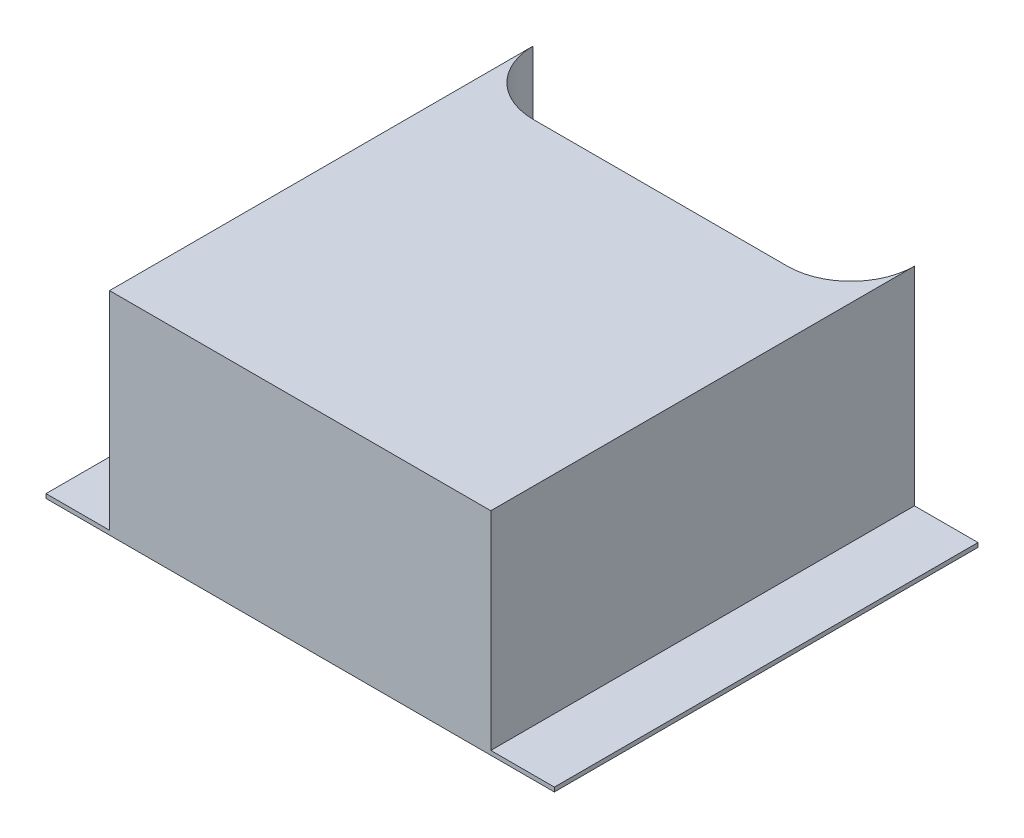
ISO-10303-21;
HEADER;
FILE_DESCRIPTION(('STEP AP214'),'2;1');
FILE_NAME('part.step','',(''),(''),'','','');
FILE_SCHEMA(('AUTOMOTIVE_DESIGN { 1 0 10303 214 1 1 1 1 }'));
ENDSEC;
DATA;
#1=APPLICATION_CONTEXT('core data for automotive mechanical design processes');
#2=APPLICATION_PROTOCOL_DEFINITION('international standard','automotive_design',2000,#1);
#3=PRODUCT_CONTEXT('',#1,'mechanical');
#4=PRODUCT('Part','Part','',(#3));
#5=PRODUCT_RELATED_PRODUCT_CATEGORY('part','',(#4));
#6=PRODUCT_DEFINITION_FORMATION('','',#4);
#7=PRODUCT_DEFINITION_CONTEXT('part definition',#1,'design');
#8=PRODUCT_DEFINITION('design','',#6,#7);
#9=PRODUCT_DEFINITION_SHAPE('','',#8);
#10=(LENGTH_UNIT() NAMED_UNIT(*) SI_UNIT(.MILLI.,.METRE.));
#11=(NAMED_UNIT(*) PLANE_ANGLE_UNIT() SI_UNIT($,.RADIAN.));
#12=(NAMED_UNIT(*) SI_UNIT($,.STERADIAN.) SOLID_ANGLE_UNIT());
#13=UNCERTAINTY_MEASURE_WITH_UNIT(LENGTH_MEASURE(1.E-05),#10,'distance_accuracy_value','');
#14=(GEOMETRIC_REPRESENTATION_CONTEXT(3) GLOBAL_UNCERTAINTY_ASSIGNED_CONTEXT((#13)) GLOBAL_UNIT_ASSIGNED_CONTEXT((#10,
#11,#12)) REPRESENTATION_CONTEXT('',''));
#15=CARTESIAN_POINT('',(0.,0.,0.));
#16=DIRECTION('',(0.,0.,1.));
#17=DIRECTION('',(1.,0.,0.));
#18=AXIS2_PLACEMENT_3D('',#15,#16,#17);
#19=CARTESIAN_POINT('',(0.,0.01,0.));
#20=DIRECTION('',(0.,1.,0.));
#21=DIRECTION('',(0.,0.,1.));
#22=AXIS2_PLACEMENT_3D('',#19,#20,#21);
#23=PLANE('',#22);
#24=DIRECTION('',(1.,0.,0.));
#25=VECTOR('',#24,1.);
#26=CARTESIAN_POINT('',(-1.87,0.01,-1.6));
#27=LINE('',#26,#25);
#28=CARTESIAN_POINT('',(-1.72,0.01,-1.6));
#29=VERTEX_POINT('',#28);
#30=CARTESIAN_POINT('',(-1.87,0.01,-1.6));
#31=VERTEX_POINT('',#30);
#32=EDGE_CURVE('E198',#29,#31,#27,.F.);
#33=ORIENTED_EDGE('',*,*,#32,.T.);
#34=DIRECTION('',(0.,0.,-1.));
#35=VECTOR('',#34,1.);
#36=CARTESIAN_POINT('',(-1.87,0.01,-0.6));
#37=LINE('',#36,#35);
#38=CARTESIAN_POINT('',(-1.87,0.01,-0.6));
#39=VERTEX_POINT('',#38);
#40=EDGE_CURVE('E126',#31,#39,#37,.F.);
#41=ORIENTED_EDGE('',*,*,#40,.T.);
#42=DIRECTION('',(-1.,0.,0.));
#43=VECTOR('',#42,1.);
#44=CARTESIAN_POINT('',(-0.67,0.01,-0.6));
#45=LINE('',#44,#43);
#46=CARTESIAN_POINT('',(-1.72,0.01,-0.6));
#47=VERTEX_POINT('',#46);
#48=EDGE_CURVE('E143',#39,#47,#45,.F.);
#49=ORIENTED_EDGE('',*,*,#48,.T.);
#50=DIRECTION('',(0.,0.,-1.));
#51=VECTOR('',#50,1.);
#52=CARTESIAN_POINT('',(-1.72,0.01,-1.6));
#53=LINE('',#52,#51);
#54=EDGE_CURVE('E207',#47,#29,#53,.T.);
#55=ORIENTED_EDGE('',*,*,#54,.T.);
#56=EDGE_LOOP('',(#33,#41,#49,#55));
#57=FACE_BOUND('',#56,.T.);
#58=ADVANCED_FACE('F17',(#57),#23,.T.);
#59=CARTESIAN_POINT('',(0.,0.01,0.));
#60=DIRECTION('',(0.,1.,0.));
#61=DIRECTION('',(0.,0.,1.));
#62=AXIS2_PLACEMENT_3D('',#59,#60,#61);
#63=PLANE('',#62);
#64=DIRECTION('',(1.,0.,0.));
#65=VECTOR('',#64,1.);
#66=CARTESIAN_POINT('',(-0.82,0.01,-1.6));
#67=LINE('',#66,#65);
#68=CARTESIAN_POINT('',(-0.67,0.01,-1.6));
#69=VERTEX_POINT('',#68);
#70=CARTESIAN_POINT('',(-0.82,0.01,-1.6));
#71=VERTEX_POINT('',#70);
#72=EDGE_CURVE('E112',#69,#71,#67,.F.);
#73=ORIENTED_EDGE('',*,*,#72,.T.);
#74=DIRECTION('',(0.,0.,1.));
#75=VECTOR('',#74,1.);
#76=CARTESIAN_POINT('',(-0.82,0.01,-1.6));
#77=LINE('',#76,#75);
#78=CARTESIAN_POINT('',(-0.82,0.01,-0.6));
#79=VERTEX_POINT('',#78);
#80=EDGE_CURVE('E70',#71,#79,#77,.T.);
#81=ORIENTED_EDGE('',*,*,#80,.T.);
#82=DIRECTION('',(-1.,0.,0.));
#83=VECTOR('',#82,1.);
#84=CARTESIAN_POINT('',(-0.67,0.01,-0.6));
#85=LINE('',#84,#83);
#86=CARTESIAN_POINT('',(-0.67,0.01,-0.6));
#87=VERTEX_POINT('',#86);
#88=EDGE_CURVE('E111',#79,#87,#85,.F.);
#89=ORIENTED_EDGE('',*,*,#88,.T.);
#90=DIRECTION('',(0.,0.,1.));
#91=VECTOR('',#90,1.);
#92=CARTESIAN_POINT('',(-0.67,0.01,-1.6));
#93=LINE('',#92,#91);
#94=EDGE_CURVE('E79',#87,#69,#93,.F.);
#95=ORIENTED_EDGE('',*,*,#94,.T.);
#96=EDGE_LOOP('',(#73,#81,#89,#95));
#97=FACE_BOUND('',#96,.T.);
#98=ADVANCED_FACE('F110',(#97),#63,.T.);
#99=CARTESIAN_POINT('',(-0.82,-3.203513695928,-1.6));
#100=DIRECTION('',(-1.,0.,0.));
#101=DIRECTION('',(0.,0.,1.));
#102=AXIS2_PLACEMENT_3D('',#99,#100,#101);
#103=PLANE('',#102);
#104=DIRECTION('',(0.,1.,0.));
#105=VECTOR('',#104,1.);
#106=CARTESIAN_POINT('',(-0.82,-1.562049935181,-1.6));
#107=LINE('',#106,#105);
#108=CARTESIAN_POINT('',(-0.82,0.5,-1.6));
#109=VERTEX_POINT('',#108);
#110=EDGE_CURVE('E219',#71,#109,#107,.T.);
#111=ORIENTED_EDGE('',*,*,#110,.T.);
#112=DIRECTION('',(0.,0.,-1.));
#113=VECTOR('',#112,1.);
#114=CARTESIAN_POINT('',(-0.82,0.5,-1.6));
#115=LINE('',#114,#113);
#116=CARTESIAN_POINT('',(-0.82,0.5,-0.6));
#117=VERTEX_POINT('',#116);
#118=EDGE_CURVE('E61',#109,#117,#115,.F.);
#119=ORIENTED_EDGE('',*,*,#118,.T.);
#120=DIRECTION('',(0.,1.,0.));
#121=VECTOR('',#120,1.);
#122=CARTESIAN_POINT('',(-0.82,-1.562049935181,-0.6));
#123=LINE('',#122,#121);
#124=EDGE_CURVE('E120',#117,#79,#123,.F.);
#125=ORIENTED_EDGE('',*,*,#124,.T.);
#126=ORIENTED_EDGE('',*,*,#80,.F.);
#127=EDGE_LOOP('',(#111,#119,#125,#126));
#128=FACE_BOUND('',#127,.T.);
#129=ADVANCED_FACE('F125',(#128),#103,.F.);
#130=CARTESIAN_POINT('',(-1.57,0.5,-1.6));
#131=DIRECTION('',(0.,-1.,0.));
#132=DIRECTION('',(0.,0.,-1.));
#133=AXIS2_PLACEMENT_3D('',#130,#131,#132);
#134=PLANE('',#133);
#135=DIRECTION('',(0.,0.,-1.));
#136=VECTOR('',#135,1.);
#137=CARTESIAN_POINT('',(-1.72,0.5,-1.6));
#138=LINE('',#137,#136);
#139=CARTESIAN_POINT('',(-1.72,0.5,-1.6));
#140=VERTEX_POINT('',#139);
#141=CARTESIAN_POINT('',(-1.72,0.5,-0.6));
#142=VERTEX_POINT('',#141);
#143=EDGE_CURVE('E202',#140,#142,#138,.F.);
#144=ORIENTED_EDGE('',*,*,#143,.T.);
#145=DIRECTION('',(-1.,0.,0.));
#146=VECTOR('',#145,1.);
#147=CARTESIAN_POINT('',(-0.67,0.5,-0.6));
#148=LINE('',#147,#146);
#149=EDGE_CURVE('E136',#142,#117,#148,.F.);
#150=ORIENTED_EDGE('',*,*,#149,.T.);
#151=ORIENTED_EDGE('',*,*,#118,.F.);
#152=CARTESIAN_POINT('',(-0.97,0.5,-1.6));
#153=DIRECTION('',(0.,1.,0.));
#154=DIRECTION('',(0.,0.,1.));
#155=AXIS2_PLACEMENT_3D('',#152,#153,#154);
#156=CIRCLE('',#155,0.15);
#157=CARTESIAN_POINT('',(-0.97,0.5,-1.45));
#158=VERTEX_POINT('',#157);
#159=EDGE_CURVE('E20',#109,#158,#156,.F.);
#160=ORIENTED_EDGE('',*,*,#159,.T.);
#161=DIRECTION('',(1.,0.,0.));
#162=VECTOR('',#161,1.);
#163=CARTESIAN_POINT('',(-1.57,0.5,-1.45));
#164=LINE('',#163,#162);
#165=CARTESIAN_POINT('',(-1.57,0.5,-1.45));
#166=VERTEX_POINT('',#165);
#167=EDGE_CURVE('E158',#158,#166,#164,.F.);
#168=ORIENTED_EDGE('',*,*,#167,.T.);
#169=CARTESIAN_POINT('',(-1.57,0.5,-1.6));
#170=DIRECTION('',(0.,1.,0.));
#171=DIRECTION('',(0.,0.,1.));
#172=AXIS2_PLACEMENT_3D('',#169,#170,#171);
#173=CIRCLE('',#172,0.15);
#174=EDGE_CURVE('E149',#166,#140,#173,.F.);
#175=ORIENTED_EDGE('',*,*,#174,.T.);
#176=EDGE_LOOP('',(#144,#150,#151,#160,#168,#175));
#177=FACE_BOUND('',#176,.T.);
#178=ADVANCED_FACE('F356',(#177),#134,.F.);
#179=CARTESIAN_POINT('',(-1.72,-3.203513695928,-1.6));
#180=DIRECTION('',(1.,0.,0.));
#181=DIRECTION('',(0.,0.,-1.));
#182=AXIS2_PLACEMENT_3D('',#179,#180,#181);
#183=PLANE('',#182);
#184=DIRECTION('',(0.,1.,0.));
#185=VECTOR('',#184,1.);
#186=CARTESIAN_POINT('',(-1.72,-1.562049935181,-1.6));
#187=LINE('',#186,#185);
#188=EDGE_CURVE('E151',#140,#29,#187,.F.);
#189=ORIENTED_EDGE('',*,*,#188,.T.);
#190=ORIENTED_EDGE('',*,*,#54,.F.);
#191=DIRECTION('',(0.,1.,0.));
#192=VECTOR('',#191,1.);
#193=CARTESIAN_POINT('',(-1.72,-1.562049935181,-0.6));
#194=LINE('',#193,#192);
#195=EDGE_CURVE('E138',#47,#142,#194,.T.);
#196=ORIENTED_EDGE('',*,*,#195,.T.);
#197=ORIENTED_EDGE('',*,*,#143,.F.);
#198=EDGE_LOOP('',(#189,#190,#196,#197));
#199=FACE_BOUND('',#198,.T.);
#200=ADVANCED_FACE('F348',(#199),#183,.F.);
#201=CARTESIAN_POINT('',(-1.87,-1.562049935181,-1.6));
#202=DIRECTION('',(0.,0.,1.));
#203=DIRECTION('',(1.,0.,0.));
#204=AXIS2_PLACEMENT_3D('',#201,#202,#203);
#205=PLANE('',#204);
#206=DIRECTION('',(0.,1.,0.));
#207=VECTOR('',#206,1.);
#208=CARTESIAN_POINT('',(-1.72,-1.562049935181,-1.6));
#209=LINE('',#208,#207);
#210=CARTESIAN_POINT('',(-1.72,0.,-1.6));
#211=VERTEX_POINT('',#210);
#212=EDGE_CURVE('E155',#29,#211,#209,.F.);
#213=ORIENTED_EDGE('',*,*,#212,.T.);
#214=DIRECTION('',(1.,0.,0.));
#215=VECTOR('',#214,1.);
#216=CARTESIAN_POINT('',(0.,0.,-1.6));
#217=LINE('',#216,#215);
#218=CARTESIAN_POINT('',(-1.87,0.,-1.6));
#219=VERTEX_POINT('',#218);
#220=EDGE_CURVE('E193',#211,#219,#217,.F.);
#221=ORIENTED_EDGE('',*,*,#220,.T.);
#222=DIRECTION('',(0.,1.,0.));
#223=VECTOR('',#222,1.);
#224=CARTESIAN_POINT('',(-1.87,-1.562049935181,-1.6));
#225=LINE('',#224,#223);
#226=EDGE_CURVE('E128',#219,#31,#225,.T.);
#227=ORIENTED_EDGE('',*,*,#226,.T.);
#228=ORIENTED_EDGE('',*,*,#32,.F.);
#229=EDGE_LOOP('',(#213,#221,#227,#228));
#230=FACE_BOUND('',#229,.T.);
#231=ADVANCED_FACE('F249',(#230),#205,.F.);
#232=CARTESIAN_POINT('',(-1.87,-1.562049935181,-0.6));
#233=DIRECTION('',(1.,0.,0.));
#234=DIRECTION('',(0.,0.,-1.));
#235=AXIS2_PLACEMENT_3D('',#232,#233,#234);
#236=PLANE('',#235);
#237=ORIENTED_EDGE('',*,*,#226,.F.);
#238=DIRECTION('',(0.,0.,1.));
#239=VECTOR('',#238,1.);
#240=CARTESIAN_POINT('',(-1.87,0.,0.));
#241=LINE('',#240,#239);
#242=CARTESIAN_POINT('',(-1.87,0.,-0.6));
#243=VERTEX_POINT('',#242);
#244=EDGE_CURVE('E184',#219,#243,#241,.T.);
#245=ORIENTED_EDGE('',*,*,#244,.T.);
#246=DIRECTION('',(0.,1.,0.));
#247=VECTOR('',#246,1.);
#248=CARTESIAN_POINT('',(-1.87,-1.562049935181,-0.6));
#249=LINE('',#248,#247);
#250=EDGE_CURVE('E123',#243,#39,#249,.T.);
#251=ORIENTED_EDGE('',*,*,#250,.T.);
#252=ORIENTED_EDGE('',*,*,#40,.F.);
#253=EDGE_LOOP('',(#237,#245,#251,#252));
#254=FACE_BOUND('',#253,.T.);
#255=ADVANCED_FACE('F240',(#254),#236,.F.);
#256=CARTESIAN_POINT('',(-0.67,-1.562049935181,-0.6));
#257=DIRECTION('',(0.,0.,-1.));
#258=DIRECTION('',(-1.,0.,0.));
#259=AXIS2_PLACEMENT_3D('',#256,#257,#258);
#260=PLANE('',#259);
#261=ORIENTED_EDGE('',*,*,#195,.F.);
#262=ORIENTED_EDGE('',*,*,#48,.F.);
#263=ORIENTED_EDGE('',*,*,#250,.F.);
#264=DIRECTION('',(1.,0.,0.));
#265=VECTOR('',#264,1.);
#266=CARTESIAN_POINT('',(0.,0.,-0.6));
#267=LINE('',#266,#265);
#268=CARTESIAN_POINT('',(-0.67,0.,-0.6));
#269=VERTEX_POINT('',#268);
#270=EDGE_CURVE('E177',#243,#269,#267,.T.);
#271=ORIENTED_EDGE('',*,*,#270,.T.);
#272=DIRECTION('',(0.,1.,0.));
#273=VECTOR('',#272,1.);
#274=CARTESIAN_POINT('',(-0.67,-1.562049935181,-0.6));
#275=LINE('',#274,#273);
#276=EDGE_CURVE('E122',#269,#87,#275,.T.);
#277=ORIENTED_EDGE('',*,*,#276,.T.);
#278=ORIENTED_EDGE('',*,*,#88,.F.);
#279=ORIENTED_EDGE('',*,*,#124,.F.);
#280=ORIENTED_EDGE('',*,*,#149,.F.);
#281=EDGE_LOOP('',(#261,#262,#263,#271,#277,#278,#279,#280));
#282=FACE_BOUND('',#281,.T.);
#283=ADVANCED_FACE('F118',(#282),#260,.F.);
#284=CARTESIAN_POINT('',(-0.67,-1.562049935181,-1.6));
#285=DIRECTION('',(-1.,0.,0.));
#286=DIRECTION('',(0.,0.,1.));
#287=AXIS2_PLACEMENT_3D('',#284,#285,#286);
#288=PLANE('',#287);
#289=ORIENTED_EDGE('',*,*,#276,.F.);
#290=DIRECTION('',(0.,0.,1.));
#291=VECTOR('',#290,1.);
#292=CARTESIAN_POINT('',(-0.67,0.,0.));
#293=LINE('',#292,#291);
#294=CARTESIAN_POINT('',(-0.67,0.,-1.6));
#295=VERTEX_POINT('',#294);
#296=EDGE_CURVE('E174',#269,#295,#293,.F.);
#297=ORIENTED_EDGE('',*,*,#296,.T.);
#298=DIRECTION('',(0.,1.,0.));
#299=VECTOR('',#298,1.);
#300=CARTESIAN_POINT('',(-0.67,-1.562049935181,-1.6));
#301=LINE('',#300,#299);
#302=EDGE_CURVE('E169',#295,#69,#301,.T.);
#303=ORIENTED_EDGE('',*,*,#302,.T.);
#304=ORIENTED_EDGE('',*,*,#94,.F.);
#305=EDGE_LOOP('',(#289,#297,#303,#304));
#306=FACE_BOUND('',#305,.T.);
#307=ADVANCED_FACE('F270',(#306),#288,.F.);
#308=CARTESIAN_POINT('',(-0.82,-1.562049935181,-1.6));
#309=DIRECTION('',(0.,0.,1.));
#310=DIRECTION('',(1.,0.,0.));
#311=AXIS2_PLACEMENT_3D('',#308,#309,#310);
#312=PLANE('',#311);
#313=ORIENTED_EDGE('',*,*,#302,.F.);
#314=DIRECTION('',(1.,0.,0.));
#315=VECTOR('',#314,1.);
#316=CARTESIAN_POINT('',(0.,0.,-1.6));
#317=LINE('',#316,#315);
#318=CARTESIAN_POINT('',(-0.82,0.,-1.6));
#319=VERTEX_POINT('',#318);
#320=EDGE_CURVE('E148',#295,#319,#317,.F.);
#321=ORIENTED_EDGE('',*,*,#320,.T.);
#322=DIRECTION('',(0.,1.,0.));
#323=VECTOR('',#322,1.);
#324=CARTESIAN_POINT('',(-0.82,-1.562049935181,-1.6));
#325=LINE('',#324,#323);
#326=EDGE_CURVE('E161',#319,#71,#325,.T.);
#327=ORIENTED_EDGE('',*,*,#326,.T.);
#328=ORIENTED_EDGE('',*,*,#72,.F.);
#329=EDGE_LOOP('',(#313,#321,#327,#328));
#330=FACE_BOUND('',#329,.T.);
#331=ADVANCED_FACE('F268',(#330),#312,.F.);
#332=CARTESIAN_POINT('',(-0.97,-1.562049935181,-1.6));
#333=DIRECTION('',(0.,1.,0.));
#334=DIRECTION('',(0.,0.,1.));
#335=AXIS2_PLACEMENT_3D('',#332,#333,#334);
#336=CYLINDRICAL_SURFACE('',#335,0.15);
#337=CARTESIAN_POINT('',(-0.97,0.,-1.6));
#338=DIRECTION('',(0.,1.,0.));
#339=DIRECTION('',(0.,0.,1.));
#340=AXIS2_PLACEMENT_3D('',#337,#338,#339);
#341=CIRCLE('',#340,0.15);
#342=CARTESIAN_POINT('',(-0.97,0.,-1.45));
#343=VERTEX_POINT('',#342);
#344=EDGE_CURVE('E146',#319,#343,#341,.F.);
#345=ORIENTED_EDGE('',*,*,#344,.T.);
#346=DIRECTION('',(0.,1.,0.));
#347=VECTOR('',#346,1.);
#348=CARTESIAN_POINT('',(-0.97,-1.562049935181,-1.45));
#349=LINE('',#348,#347);
#350=EDGE_CURVE('E152',#343,#158,#349,.T.);
#351=ORIENTED_EDGE('',*,*,#350,.T.);
#352=ORIENTED_EDGE('',*,*,#159,.F.);
#353=ORIENTED_EDGE('',*,*,#110,.F.);
#354=ORIENTED_EDGE('',*,*,#326,.F.);
#355=EDGE_LOOP('',(#345,#351,#352,#353,#354));
#356=FACE_BOUND('',#355,.T.);
#357=ADVANCED_FACE('F265',(#356),#336,.F.);
#358=CARTESIAN_POINT('',(-1.57,-1.562049935181,-1.45));
#359=DIRECTION('',(0.,0.,1.));
#360=DIRECTION('',(1.,0.,0.));
#361=AXIS2_PLACEMENT_3D('',#358,#359,#360);
#362=PLANE('',#361);
#363=DIRECTION('',(1.,0.,0.));
#364=VECTOR('',#363,1.);
#365=CARTESIAN_POINT('',(0.,0.,-1.45));
#366=LINE('',#365,#364);
#367=CARTESIAN_POINT('',(-1.57,0.,-1.45));
#368=VERTEX_POINT('',#367);
#369=EDGE_CURVE('E26',#343,#368,#366,.F.);
#370=ORIENTED_EDGE('',*,*,#369,.T.);
#371=DIRECTION('',(0.,1.,0.));
#372=VECTOR('',#371,1.);
#373=CARTESIAN_POINT('',(-1.57,-1.562049935181,-1.45));
#374=LINE('',#373,#372);
#375=EDGE_CURVE('E34',#368,#166,#374,.T.);
#376=ORIENTED_EDGE('',*,*,#375,.T.);
#377=ORIENTED_EDGE('',*,*,#167,.F.);
#378=ORIENTED_EDGE('',*,*,#350,.F.);
#379=EDGE_LOOP('',(#370,#376,#377,#378));
#380=FACE_BOUND('',#379,.T.);
#381=ADVANCED_FACE('F262',(#380),#362,.F.);
#382=CARTESIAN_POINT('',(-1.57,-1.562049935181,-1.6));
#383=DIRECTION('',(0.,1.,0.));
#384=DIRECTION('',(0.,0.,1.));
#385=AXIS2_PLACEMENT_3D('',#382,#383,#384);
#386=CYLINDRICAL_SURFACE('',#385,0.15);
#387=CARTESIAN_POINT('',(-1.57,0.,-1.6));
#388=DIRECTION('',(0.,1.,0.));
#389=DIRECTION('',(0.,0.,1.));
#390=AXIS2_PLACEMENT_3D('',#387,#388,#389);
#391=CIRCLE('',#390,0.15);
#392=EDGE_CURVE('E11',#368,#211,#391,.F.);
#393=ORIENTED_EDGE('',*,*,#392,.T.);
#394=ORIENTED_EDGE('',*,*,#212,.F.);
#395=ORIENTED_EDGE('',*,*,#188,.F.);
#396=ORIENTED_EDGE('',*,*,#174,.F.);
#397=ORIENTED_EDGE('',*,*,#375,.F.);
#398=EDGE_LOOP('',(#393,#394,#395,#396,#397));
#399=FACE_BOUND('',#398,.T.);
#400=ADVANCED_FACE('F281',(#399),#386,.F.);
#401=CARTESIAN_POINT('',(0.,0.,0.));
#402=DIRECTION('',(0.,1.,0.));
#403=DIRECTION('',(0.,0.,1.));
#404=AXIS2_PLACEMENT_3D('',#401,#402,#403);
#405=PLANE('',#404);
#406=ORIENTED_EDGE('',*,*,#369,.F.);
#407=ORIENTED_EDGE('',*,*,#344,.F.);
#408=ORIENTED_EDGE('',*,*,#320,.F.);
#409=ORIENTED_EDGE('',*,*,#296,.F.);
#410=ORIENTED_EDGE('',*,*,#270,.F.);
#411=ORIENTED_EDGE('',*,*,#244,.F.);
#412=ORIENTED_EDGE('',*,*,#220,.F.);
#413=ORIENTED_EDGE('',*,*,#392,.F.);
#414=EDGE_LOOP('',(#406,#407,#408,#409,#410,#411,#412,#413));
#415=FACE_BOUND('',#414,.T.);
#416=ADVANCED_FACE('F245',(#415),#405,.F.);
#417=CLOSED_SHELL('',(#58,#98,#129,#178,#200,#231,#255,#283,#307,#331,#357,#381,#400,#416));
#418=MANIFOLD_SOLID_BREP('B1',#417);
#419=ADVANCED_BREP_SHAPE_REPRESENTATION('',(#18,#418),#14);
#420=SHAPE_DEFINITION_REPRESENTATION(#9,#419);
ENDSEC;
END-ISO-10303-21;
